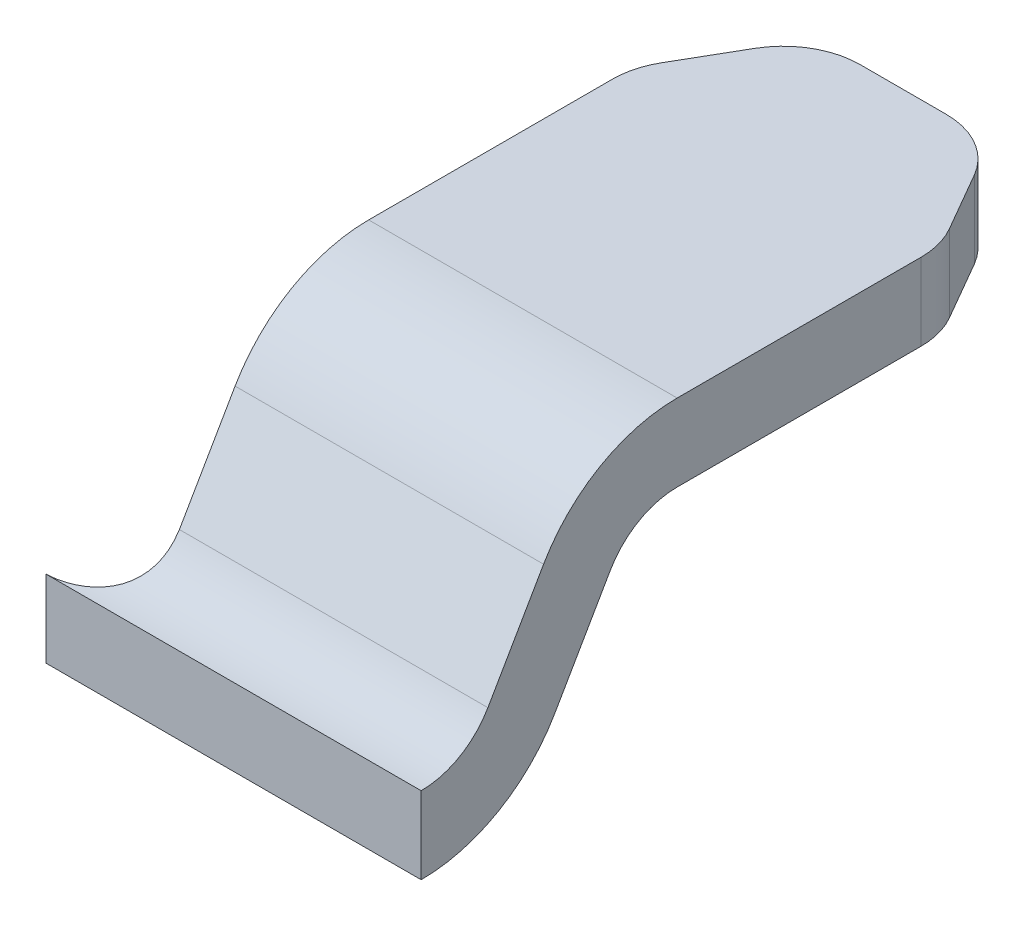
ISO-10303-21;
HEADER;
FILE_DESCRIPTION(('STEP AP214'),'2;1');
FILE_NAME('part.step','',(''),(''),'','','');
FILE_SCHEMA(('AUTOMOTIVE_DESIGN { 1 0 10303 214 1 1 1 1 }'));
ENDSEC;
DATA;
#1=APPLICATION_CONTEXT('core data for automotive mechanical design processes');
#2=APPLICATION_PROTOCOL_DEFINITION('international standard','automotive_design',2000,#1);
#3=PRODUCT_CONTEXT('',#1,'mechanical');
#4=PRODUCT('Part','Part','',(#3));
#5=PRODUCT_RELATED_PRODUCT_CATEGORY('part','',(#4));
#6=PRODUCT_DEFINITION_FORMATION('','',#4);
#7=PRODUCT_DEFINITION_CONTEXT('part definition',#1,'design');
#8=PRODUCT_DEFINITION('design','',#6,#7);
#9=PRODUCT_DEFINITION_SHAPE('','',#8);
#10=(LENGTH_UNIT() NAMED_UNIT(*) SI_UNIT(.MILLI.,.METRE.));
#11=(NAMED_UNIT(*) PLANE_ANGLE_UNIT() SI_UNIT($,.RADIAN.));
#12=(NAMED_UNIT(*) SI_UNIT($,.STERADIAN.) SOLID_ANGLE_UNIT());
#13=UNCERTAINTY_MEASURE_WITH_UNIT(LENGTH_MEASURE(1.E-05),#10,'distance_accuracy_value','');
#14=(GEOMETRIC_REPRESENTATION_CONTEXT(3) GLOBAL_UNCERTAINTY_ASSIGNED_CONTEXT((#13)) GLOBAL_UNIT_ASSIGNED_CONTEXT((#10,
#11,#12)) REPRESENTATION_CONTEXT('',''));
#15=CARTESIAN_POINT('',(0.,0.,0.));
#16=DIRECTION('',(0.,0.,1.));
#17=DIRECTION('',(1.,0.,0.));
#18=AXIS2_PLACEMENT_3D('',#15,#16,#17);
#19=CARTESIAN_POINT('',(-5.699968942605,3.500000000009,-3.65014050948));
#20=DIRECTION('',(0.,-2.126490095122E-11,1.));
#21=DIRECTION('',(0.,-1.,-2.126490095122E-11));
#22=AXIS2_PLACEMENT_3D('',#19,#20,#21);
#23=PLANE('',#22);
#24=DIRECTION('',(-2.263504939037E-11,1.,0.));
#25=VECTOR('',#24,1.);
#26=CARTESIAN_POINT('',(-5.699968942605,3.500000000008,-3.650140509429));
#27=LINE('',#26,#25);
#28=CARTESIAN_POINT('',(-5.69996894267712,5.95000004938576,-3.650140509429));
#29=VERTEX_POINT('',#28);
#30=CARTESIAN_POINT('',(-5.69996894266426,5.75000002470708,-3.650140509429));
#31=VERTEX_POINT('',#30);
#32=EDGE_CURVE('E410',#29,#31,#27,.F.);
#33=ORIENTED_EDGE('',*,*,#32,.F.);
#34=DIRECTION('',(-1.,-3.551554605963E-11,1.351452283416E-12));
#35=VECTOR('',#34,1.);
#36=CARTESIAN_POINT('',(-3.5999689427069,5.95000004946034,-3.65014050943184));
#37=LINE('',#36,#35);
#38=CARTESIAN_POINT('',(-6.67285812874747,5.9500000493512,-3.6501405094277));
#39=VERTEX_POINT('',#38);
#40=EDGE_CURVE('E439',#29,#39,#37,.T.);
#41=ORIENTED_EDGE('',*,*,#40,.T.);
#42=DIRECTION('',(-2.263504939037E-11,1.,2.126490095122E-11));
#43=VECTOR('',#42,1.);
#44=CARTESIAN_POINT('',(-6.67285812869157,3.49999999994734,-3.65014050947982));
#45=LINE('',#44,#43);
#46=CARTESIAN_POINT('',(-6.67285812879673,5.75000002467253,-3.65014050942983));
#47=VERTEX_POINT('',#46);
#48=EDGE_CURVE('E157',#39,#47,#45,.F.);
#49=ORIENTED_EDGE('',*,*,#48,.T.);
#50=DIRECTION('',(-1.,-3.551554605963E-11,1.351452283416E-12));
#51=VECTOR('',#50,1.);
#52=CARTESIAN_POINT('',(-3.59996894269979,5.75000002478167,-3.65014050943184));
#53=LINE('',#52,#51);
#54=EDGE_CURVE('E158',#31,#47,#53,.T.);
#55=ORIENTED_EDGE('',*,*,#54,.F.);
#56=EDGE_LOOP('',(#33,#41,#49,#55));
#57=FACE_BOUND('',#56,.T.);
#58=ADVANCED_FACE('F17',(#57),#23,.T.);
#59=CARTESIAN_POINT('',(-3.599968942714,6.150000000103,-3.649999999884));
#60=DIRECTION('',(-1.,-3.551554605963E-11,1.351452283416E-12));
#61=DIRECTION('',(3.551554605963E-11,-1.,0.));
#62=AXIS2_PLACEMENT_3D('',#59,#60,#61);
#63=CYLINDRICAL_SURFACE('',#62,0.2);
#64=CARTESIAN_POINT('',(-5.69996894269832,6.15000000002842,-3.64999999988116));
#65=DIRECTION('',(-1.,-3.551554605963E-11,1.351452283416E-12));
#66=DIRECTION('',(3.551554605963E-11,-1.,0.));
#67=AXIS2_PLACEMENT_3D('',#64,#65,#66);
#68=CIRCLE('',#67,0.2);
#69=CARTESIAN_POINT('',(-5.69996894267886,6.05000000001963,-3.82320508063325));
#70=VERTEX_POINT('',#69);
#71=EDGE_CURVE('E143',#70,#29,#68,.T.);
#72=ORIENTED_EDGE('',*,*,#71,.F.);
#73=DIRECTION('',(1.,8.29369051018556E-12,1.43650933458926E-11));
#74=VECTOR('',#73,1.);
#75=CARTESIAN_POINT('',(-3.599968942714,6.05000000002806,-3.82320508059732));
#76=LINE('',#75,#74);
#77=CARTESIAN_POINT('',(-6.50009724096356,6.05000000000395,-3.8232050806391));
#78=VERTEX_POINT('',#77);
#79=EDGE_CURVE('E137',#78,#70,#76,.T.);
#80=ORIENTED_EDGE('',*,*,#79,.F.);
#81=CARTESIAN_POINT('',(-6.50009724096355,6.05000000000389,-3.82320508063921));
#82=CARTESIAN_POINT('',(-6.50027779439027,6.04180177501456,-3.8184880911682));
#83=CARTESIAN_POINT('',(-6.50066283096496,6.03393993950835,-3.8131586965198));
#84=CARTESIAN_POINT('',(-6.50214723236821,6.01904413826587,-3.80145713343716));
#85=CARTESIAN_POINT('',(-6.50325049159644,6.01201493433766,-3.79507942250809));
#86=CARTESIAN_POINT('',(-6.50649046032339,5.99899691891201,-3.78148134066602));
#87=CARTESIAN_POINT('',(-6.50863295384615,5.99301418836139,-3.77425642722597));
#88=CARTESIAN_POINT('',(-6.51420230024425,5.98232745372562,-3.75940348178897));
#89=CARTESIAN_POINT('',(-6.51762437883242,5.97761880706675,-3.75177703772102));
#90=CARTESIAN_POINT('',(-6.52542139363501,5.96994317187697,-3.7374007378076));
#91=CARTESIAN_POINT('',(-6.52965501972936,5.96684365907508,-3.73064448068836));
#92=CARTESIAN_POINT('',(-6.53920309521606,5.96161080618487,-3.71752405957404));
#93=CARTESIAN_POINT('',(-6.5445186534827,5.95947846464955,-3.71116030664719));
#94=CARTESIAN_POINT('',(-6.55592005902789,5.95608141431003,-3.69931966641478));
#95=CARTESIAN_POINT('',(-6.56197591301083,5.95479119006002,-3.69382095875297));
#96=CARTESIAN_POINT('',(-6.57483738683504,5.95278523118182,-3.68366281258559));
#97=CARTESIAN_POINT('',(-6.58164317311259,5.95206962437463,-3.67900356099184));
#98=CARTESIAN_POINT('',(-6.59658011011388,5.95097066746399,-3.67022236671587));
#99=CARTESIAN_POINT('',(-6.60477558921674,5.95062901378791,-3.6662048290624));
#100=CARTESIAN_POINT('',(-6.62168455453615,5.95019483442758,-3.65945448749944));
#101=CARTESIAN_POINT('',(-6.63039795717038,5.95010226865657,-3.65672147692408));
#102=CARTESIAN_POINT('',(-6.64478047300666,5.95002455662213,-3.65338200668197));
#103=CARTESIAN_POINT('',(-6.6503569225307,5.95001204890544,-3.6523622421306));
#104=CARTESIAN_POINT('',(-6.66157083672502,5.95000087516357,-3.65085347021194));
#105=CARTESIAN_POINT('',(-6.6672081717618,5.95000218396852,-3.65036349950233));
#106=CARTESIAN_POINT('',(-6.67285812874703,5.9500000493512,-3.65014050942772));
#107=B_SPLINE_CURVE_WITH_KNOTS('',3,(#81,#82,#83,#84,#85,#86,#87,#88,#89,#90,#91,#92,#93,#94,
#95,#96,#97,#98,#99,#100,#101,#102,#103,#104,#105,#106),.UNSPECIFIED.,.F.,.F.,(4,2,2,2,2,2,2,2,
2,2,2,2,4),(0.,0.0283828798519999,0.0569209558916135,0.0856197199956834,0.114212457002599,
0.139742802926945,0.16529944791172,0.190040561556663,0.214787177224521,0.242076610263373,
0.269361651236865,0.286345287768334,0.303297990167384),.UNSPECIFIED.);
#108=EDGE_CURVE('E20',#78,#39,#107,.T.);
#109=ORIENTED_EDGE('',*,*,#108,.T.);
#110=ORIENTED_EDGE('',*,*,#40,.F.);
#111=EDGE_LOOP('',(#72,#80,#109,#110));
#112=FACE_BOUND('',#111,.T.);
#113=ADVANCED_FACE('F139',(#112),#63,.F.);
#114=CARTESIAN_POINT('',(-3.599968942714,6.100000000103,-4.313952809452));
#115=DIRECTION('',(-1.,-3.551554605963E-11,1.351452283416E-12));
#116=DIRECTION('',(3.551554605963E-11,-1.,0.));
#117=AXIS2_PLACEMENT_3D('',#114,#115,#116);
#118=CYLINDRICAL_SURFACE('',#117,0.4);
#119=DIRECTION('',(-1.,-3.551554605963E-11,0.));
#120=VECTOR('',#119,1.);
#121=CARTESIAN_POINT('',(-3.599968942714,6.50000000010272,-4.31395280947));
#122=LINE('',#121,#120);
#123=CARTESIAN_POINT('',(-6.49996894267895,6.50000000000143,-4.31395280945904));
#124=VERTEX_POINT('',#123);
#125=CARTESIAN_POINT('',(-5.69996894268224,6.50000000003328,-4.31395280945958));
#126=VERTEX_POINT('',#125);
#127=EDGE_CURVE('E164',#124,#126,#122,.F.);
#128=ORIENTED_EDGE('',*,*,#127,.F.);
#129=CARTESIAN_POINT('',(-6.49996894267179,6.10000000000001,-4.31395280944808));
#130=DIRECTION('',(-1.,-3.551554605963E-11,1.351452283416E-12));
#131=DIRECTION('',(3.551554605963E-11,-1.,0.));
#132=AXIS2_PLACEMENT_3D('',#129,#130,#131);
#133=CIRCLE('',#132,0.4);
#134=CARTESIAN_POINT('',(-6.49996894267843,6.30000000001457,-3.96754264794256));
#135=VERTEX_POINT('',#134);
#136=EDGE_CURVE('E396',#135,#124,#133,.T.);
#137=ORIENTED_EDGE('',*,*,#136,.F.);
#138=DIRECTION('',(1.,8.29369051018556E-12,1.43650933458926E-11));
#139=VECTOR('',#138,1.);
#140=CARTESIAN_POINT('',(-3.599968942714,6.30000000004427,-3.96754264790409));
#141=LINE('',#140,#139);
#142=CARTESIAN_POINT('',(-5.69996894267619,6.30000000002692,-3.96754264793413));
#143=VERTEX_POINT('',#142);
#144=EDGE_CURVE('E148',#143,#135,#141,.F.);
#145=ORIENTED_EDGE('',*,*,#144,.F.);
#146=CARTESIAN_POINT('',(-5.69996894267737,6.10000000002842,-4.31395280944916));
#147=DIRECTION('',(-1.,-3.551554605963E-11,1.351452283416E-12));
#148=DIRECTION('',(3.551554605963E-11,-1.,0.));
#149=AXIS2_PLACEMENT_3D('',#146,#147,#148);
#150=CIRCLE('',#149,0.4);
#151=EDGE_CURVE('E403',#126,#143,#150,.F.);
#152=ORIENTED_EDGE('',*,*,#151,.F.);
#153=EDGE_LOOP('',(#128,#137,#145,#152));
#154=FACE_BOUND('',#153,.T.);
#155=ADVANCED_FACE('F186',(#154),#118,.T.);
#156=CARTESIAN_POINT('',(-3.599968942714,5.950000000103,-3.996410161398));
#157=DIRECTION('',(1.65873810203699E-11,-0.499999999999899,-0.866025403784497));
#158=DIRECTION('',(0.,0.866025403784497,-0.499999999999899));
#159=AXIS2_PLACEMENT_3D('',#156,#157,#158);
#160=PLANE('',#159);
#161=DIRECTION('',(-1.,-3.551554605963E-11,1.351452283416E-12));
#162=VECTOR('',#161,1.);
#163=CARTESIAN_POINT('',(-3.59996894270737,5.95000000010811,-3.99641016140072));
#164=LINE('',#163,#162);
#165=CARTESIAN_POINT('',(-6.49996894266563,5.95000000000225,-3.99641016139534));
#166=VERTEX_POINT('',#165);
#167=CARTESIAN_POINT('',(-5.69996894266773,5.95000000002876,-3.99641016139544));
#168=VERTEX_POINT('',#167);
#169=EDGE_CURVE('E437',#166,#168,#164,.F.);
#170=ORIENTED_EDGE('',*,*,#169,.F.);
#171=DIRECTION('',(1.96022008841507E-11,-0.866025403783781,0.500000000001139));
#172=VECTOR('',#171,1.);
#173=CARTESIAN_POINT('',(-6.49996894266511,6.200000000007,-4.140747728696));
#174=LINE('',#173,#172);
#175=CARTESIAN_POINT('',(-6.49996894268266,6.20000000000717,-4.14074772869571));
#176=VERTEX_POINT('',#175);
#177=EDGE_CURVE('E392',#176,#166,#174,.T.);
#178=ORIENTED_EDGE('',*,*,#177,.F.);
#179=DIRECTION('',(-1.,-3.551554605963E-11,1.351452283416E-12));
#180=VECTOR('',#179,1.);
#181=CARTESIAN_POINT('',(-3.59996894271732,6.20000000011033,-4.14074772869934));
#182=LINE('',#181,#180);
#183=CARTESIAN_POINT('',(-5.69996894268206,6.20000000002987,-4.14074772869325));
#184=VERTEX_POINT('',#183);
#185=EDGE_CURVE('E400',#176,#184,#182,.F.);
#186=ORIENTED_EDGE('',*,*,#185,.T.);
#187=DIRECTION('',(-1.96022008843363E-11,0.866025403785049,-0.499999999998943));
#188=VECTOR('',#187,1.);
#189=CARTESIAN_POINT('',(-5.69996894266046,5.950000000024,-3.996410161393));
#190=LINE('',#189,#188);
#191=EDGE_CURVE('E409',#168,#184,#190,.T.);
#192=ORIENTED_EDGE('',*,*,#191,.F.);
#193=EDGE_LOOP('',(#170,#178,#186,#192));
#194=FACE_BOUND('',#193,.T.);
#195=ADVANCED_FACE('F182',(#194),#160,.T.);
#196=CARTESIAN_POINT('',(-3.599968942714,6.150000000103,-3.649999999884));
#197=DIRECTION('',(-1.,-3.551554605963E-11,1.351452283416E-12));
#198=DIRECTION('',(3.551554605963E-11,-1.,0.));
#199=AXIS2_PLACEMENT_3D('',#196,#197,#198);
#200=CYLINDRICAL_SURFACE('',#199,0.4);
#201=CARTESIAN_POINT('',(-6.67285812874499,5.75000002467253,-3.65014050943187));
#202=CARTESIAN_POINT('',(-6.66276903925641,5.75001060580209,-3.65053078995445));
#203=CARTESIAN_POINT('',(-6.65271634494505,5.75000131045122,-3.65178649992532));
#204=CARTESIAN_POINT('',(-6.63296313150004,5.75003615282917,-3.65595551333938));
#205=CARTESIAN_POINT('',(-6.62326252598787,5.75008027735987,-3.65886840725865));
#206=CARTESIAN_POINT('',(-6.60448151002414,5.75031513508185,-3.66628119837156));
#207=CARTESIAN_POINT('',(-6.59540150715223,5.75050596363218,-3.67078212677313));
#208=CARTESIAN_POINT('',(-6.57813281158542,5.75118691255975,-3.68123457741161));
#209=CARTESIAN_POINT('',(-6.56994387989525,5.75167695245087,-3.68718570929359));
#210=CARTESIAN_POINT('',(-6.55477936131802,5.7531189963216,-3.70028157227595));
#211=CARTESIAN_POINT('',(-6.54779191225092,5.75406608436189,-3.7074130829485));
#212=CARTESIAN_POINT('',(-6.53513443181458,5.75657975828739,-3.72266387303066));
#213=CARTESIAN_POINT('',(-6.5294637277814,5.75814602675194,-3.73078264485005));
#214=CARTESIAN_POINT('',(-6.51975481422064,5.7619519502913,-3.74741086685393));
#215=CARTESIAN_POINT('',(-6.51566710526881,5.76416655464111,-3.75589723044443));
#216=CARTESIAN_POINT('',(-6.50891074035316,5.76934068635508,-3.77320722318115));
#217=CARTESIAN_POINT('',(-6.50624280403431,5.77230059037422,-3.78203102093971));
#218=CARTESIAN_POINT('',(-6.50280779230196,5.77810198593914,-3.79744966016726));
#219=CARTESIAN_POINT('',(-6.50172955371984,5.78078139477875,-3.80403942795247));
#220=CARTESIAN_POINT('',(-6.50031011532164,5.78651203838595,-3.81711642866073));
#221=CARTESIAN_POINT('',(-6.49996701674113,5.78956229369722,-3.82360388266987));
#222=CARTESIAN_POINT('',(-6.49996894265495,5.79278857796608,-3.82999999979268));
#223=B_SPLINE_CURVE_WITH_KNOTS('',3,(#201,#202,#203,#204,#205,#206,#207,#208,#209,#210,#211,
#212,#213,#214,#215,#216,#217,#218,#219,#220,#221,#222),.UNSPECIFIED.,.F.,.F.,(4,2,2,2,2,2,2,2,
2,2,4),(0.,0.0302505519788779,0.0604936316753317,0.0907563863081787,0.121011004019698,
0.150947225011804,0.180868119166092,0.209758479597707,0.238663469870065,0.260201633917041,
0.28168410048437),.UNSPECIFIED.);
#224=CARTESIAN_POINT('',(-6.49996894266325,5.79278857796801,-3.82999999979642));
#225=VERTEX_POINT('',#224);
#226=EDGE_CURVE('E149',#47,#225,#223,.T.);
#227=ORIENTED_EDGE('',*,*,#226,.T.);
#228=CARTESIAN_POINT('',(-6.49996894267844,6.15000000000001,-3.64999999988008));
#229=DIRECTION('',(-1.,-3.551554605963E-11,1.351452283416E-12));
#230=DIRECTION('',(3.551554605963E-11,-1.,0.));
#231=AXIS2_PLACEMENT_3D('',#228,#229,#230);
#232=CIRCLE('',#231,0.4);
#233=EDGE_CURVE('E389',#166,#225,#232,.T.);
#234=ORIENTED_EDGE('',*,*,#233,.F.);
#235=ORIENTED_EDGE('',*,*,#169,.T.);
#236=CARTESIAN_POINT('',(-5.69996894268164,6.15000000002842,-3.64999999988116));
#237=DIRECTION('',(-1.,-3.551554605963E-11,1.351452283416E-12));
#238=DIRECTION('',(3.551554605963E-11,-1.,0.));
#239=AXIS2_PLACEMENT_3D('',#236,#237,#238);
#240=CIRCLE('',#239,0.4);
#241=EDGE_CURVE('E407',#31,#168,#240,.F.);
#242=ORIENTED_EDGE('',*,*,#241,.F.);
#243=ORIENTED_EDGE('',*,*,#54,.T.);
#244=EDGE_LOOP('',(#227,#234,#235,#242,#243));
#245=FACE_BOUND('',#244,.T.);
#246=ADVANCED_FACE('F178',(#245),#200,.T.);
#247=CARTESIAN_POINT('',(-6.679968942604,3.499999999951,-3.829999999987));
#248=DIRECTION('',(-2.263504939037E-11,1.,2.126490095122E-11));
#249=DIRECTION('',(-1.,-2.263504939037E-11,0.));
#250=AXIS2_PLACEMENT_3D('',#247,#248,#249);
#251=CYLINDRICAL_SURFACE('',#250,0.18);
#252=DIRECTION('',(2.263504939037E-11,-1.,0.));
#253=VECTOR('',#252,1.);
#254=CARTESIAN_POINT('',(-6.499968942604,3.499999999951,-3.8299999998));
#255=LINE('',#254,#253);
#256=CARTESIAN_POINT('',(-6.49996894266199,6.06176914533899,-3.82999999986626));
#257=VERTEX_POINT('',#256);
#258=EDGE_CURVE('E385',#225,#257,#255,.F.);
#259=ORIENTED_EDGE('',*,*,#258,.F.);
#260=ORIENTED_EDGE('',*,*,#226,.F.);
#261=ORIENTED_EDGE('',*,*,#48,.F.);
#262=ORIENTED_EDGE('',*,*,#108,.F.);
#263=CARTESIAN_POINT('',(-6.67996894266199,6.06176914544779,-3.82999999993252));
#264=DIRECTION('',(-1.65873810203706E-11,0.500000000000017,0.866025403784429));
#265=DIRECTION('',(-1.65599748198898E-11,0.866025403784429,-0.500000000000017));
#266=AXIS2_PLACEMENT_3D('',#263,#264,#265);
#267=ELLIPSE('',#266,0.359999999986728,0.18);
#268=EDGE_CURVE('E154',#257,#78,#267,.F.);
#269=ORIENTED_EDGE('',*,*,#268,.F.);
#270=EDGE_LOOP('',(#259,#260,#261,#262,#269));
#271=FACE_BOUND('',#270,.T.);
#272=ADVANCED_FACE('F153',(#271),#251,.F.);
#273=CARTESIAN_POINT('',(-3.599968942714,6.300000000103,-3.967542647938));
#274=DIRECTION('',(-1.65873810203706E-11,0.500000000000017,0.866025403784429));
#275=DIRECTION('',(0.,-0.866025403784429,0.500000000000017));
#276=AXIS2_PLACEMENT_3D('',#273,#274,#275);
#277=PLANE('',#276);
#278=DIRECTION('',(-1.9602603270502E-11,0.866025403742388,-0.500000000072834));
#279=VECTOR('',#278,1.);
#280=CARTESIAN_POINT('',(-6.49996894266199,6.061769145378,-3.829999999862));
#281=LINE('',#280,#279);
#282=EDGE_CURVE('E162',#257,#135,#281,.T.);
#283=ORIENTED_EDGE('',*,*,#282,.F.);
#284=ORIENTED_EDGE('',*,*,#268,.T.);
#285=ORIENTED_EDGE('',*,*,#79,.T.);
#286=DIRECTION('',(1.96022008846734E-11,-0.866025403786084,0.49999999999715));
#287=VECTOR('',#286,1.);
#288=CARTESIAN_POINT('',(-5.69996894266838,6.300000000027,-3.967542647934));
#289=LINE('',#288,#287);
#290=EDGE_CURVE('E402',#143,#70,#289,.T.);
#291=ORIENTED_EDGE('',*,*,#290,.F.);
#292=ORIENTED_EDGE('',*,*,#144,.T.);
#293=EDGE_LOOP('',(#283,#284,#285,#291,#292));
#294=FACE_BOUND('',#293,.T.);
#295=ADVANCED_FACE('F159',(#294),#277,.T.);
#296=CARTESIAN_POINT('',(-3.599968942714,6.500000000103,-5.399999999884));
#297=DIRECTION('',(-3.551554605963E-11,1.,2.614766152764E-13));
#298=DIRECTION('',(-1.,-3.551554605963E-11,0.));
#299=AXIS2_PLACEMENT_3D('',#296,#297,#298);
#300=PLANE('',#299);
#301=CARTESIAN_POINT('',(-6.29996894267191,6.50000000001553,-4.94641016143721));
#302=DIRECTION('',(-2.263504939037E-11,1.,2.126490095122E-11));
#303=DIRECTION('',(-1.,-2.263504939037E-11,0.));
#304=AXIS2_PLACEMENT_3D('',#301,#302,#303);
#305=CIRCLE('',#304,0.2);
#306=CARTESIAN_POINT('',(-6.4999689426719,6.5000000000065,-4.9464101614266));
#307=VERTEX_POINT('',#306);
#308=CARTESIAN_POINT('',(-6.47317402342659,6.50000000002237,-5.04641016144113));
#309=VERTEX_POINT('',#308);
#310=EDGE_CURVE('E369',#307,#309,#305,.F.);
#311=ORIENTED_EDGE('',*,*,#310,.F.);
#312=DIRECTION('',(0.,0.,1.));
#313=VECTOR('',#312,1.);
#314=CARTESIAN_POINT('',(-6.4999689426719,6.500000000002,-3.829999999987));
#315=LINE('',#314,#313);
#316=EDGE_CURVE('E371',#124,#307,#315,.F.);
#317=ORIENTED_EDGE('',*,*,#316,.F.);
#318=ORIENTED_EDGE('',*,*,#127,.T.);
#319=DIRECTION('',(0.,0.,1.));
#320=VECTOR('',#319,1.);
#321=CARTESIAN_POINT('',(-5.69996894267291,6.500000000035,-5.046410161501));
#322=LINE('',#321,#320);
#323=CARTESIAN_POINT('',(-5.69996894267291,6.50000000003524,-4.9464101614511));
#324=VERTEX_POINT('',#323);
#325=EDGE_CURVE('E406',#324,#126,#322,.T.);
#326=ORIENTED_EDGE('',*,*,#325,.F.);
#327=CARTESIAN_POINT('',(-5.8999689426729,6.50000000003095,-4.94641016143721));
#328=DIRECTION('',(-2.263504939037E-11,1.,2.126490095122E-11));
#329=DIRECTION('',(-1.,-2.263504939037E-11,0.));
#330=AXIS2_PLACEMENT_3D('',#327,#328,#329);
#331=CIRCLE('',#330,0.2);
#332=CARTESIAN_POINT('',(-5.72676386191499,6.5000000000425,-5.0464101614359));
#333=VERTEX_POINT('',#332);
#334=EDGE_CURVE('E411',#333,#324,#331,.F.);
#335=ORIENTED_EDGE('',*,*,#334,.F.);
#336=DIRECTION('',(-0.49999999999819,0.,-0.866025403785483));
#337=VECTOR('',#336,1.);
#338=CARTESIAN_POINT('',(-5.81543899652055,6.500000000048,-5.19999999994165));
#339=LINE('',#338,#337);
#340=CARTESIAN_POINT('',(-5.81543899651036,6.5000000000399,-5.199999999924));
#341=VERTEX_POINT('',#340);
#342=EDGE_CURVE('E418',#341,#333,#339,.F.);
#343=ORIENTED_EDGE('',*,*,#342,.F.);
#344=CARTESIAN_POINT('',(-5.9886440772669,6.50000000002575,-5.09999999992321));
#345=DIRECTION('',(-2.263504939037E-11,1.,2.126490095122E-11));
#346=DIRECTION('',(-1.,-2.263504939037E-11,0.));
#347=AXIS2_PLACEMENT_3D('',#344,#345,#346);
#348=CIRCLE('',#347,0.2);
#349=CARTESIAN_POINT('',(-5.98864407662526,6.5000000000355,-5.29999999990199));
#350=VERTEX_POINT('',#349);
#351=EDGE_CURVE('E170',#350,#341,#348,.F.);
#352=ORIENTED_EDGE('',*,*,#351,.F.);
#353=DIRECTION('',(-1.,0.,1.351452283416E-12));
#354=VECTOR('',#353,1.);
#355=CARTESIAN_POINT('',(-3.599968942714,6.500000000041,-5.299999999884));
#356=LINE('',#355,#354);
#357=CARTESIAN_POINT('',(-6.2112938089285,6.50000000003202,-5.29999999990184));
#358=VERTEX_POINT('',#357);
#359=EDGE_CURVE('E166',#358,#350,#356,.F.);
#360=ORIENTED_EDGE('',*,*,#359,.F.);
#361=CARTESIAN_POINT('',(-6.2112938080779,6.50000000001879,-5.09999999992321));
#362=DIRECTION('',(-2.263504939037E-11,1.,2.126490095122E-11));
#363=DIRECTION('',(-1.,-2.263504939037E-11,0.));
#364=AXIS2_PLACEMENT_3D('',#361,#362,#363);
#365=CIRCLE('',#364,0.2);
#366=CARTESIAN_POINT('',(-6.38449888883501,6.500000000024,-5.19999999992273));
#367=VERTEX_POINT('',#366);
#368=EDGE_CURVE('E453',#367,#358,#365,.F.);
#369=ORIENTED_EDGE('',*,*,#368,.F.);
#370=DIRECTION('',(-0.499999999998072,0.,0.866025403785552));
#371=VECTOR('',#370,1.);
#372=CARTESIAN_POINT('',(-6.4731740233843,6.500000000031,-5.04641016151446));
#373=LINE('',#372,#371);
#374=EDGE_CURVE('E374',#309,#367,#373,.F.);
#375=ORIENTED_EDGE('',*,*,#374,.F.);
#376=EDGE_LOOP('',(#311,#317,#318,#326,#335,#343,#352,#360,#369,#375));
#377=FACE_BOUND('',#376,.T.);
#378=ADVANCED_FACE('F243',(#377),#300,.T.);
#379=CARTESIAN_POINT('',(-3.599968942714,6.300000000104,-5.299999999884));
#380=DIRECTION('',(-1.351452283416E-12,0.,-1.));
#381=DIRECTION('',(-1.,0.,1.351452283416E-12));
#382=AXIS2_PLACEMENT_3D('',#379,#380,#381);
#383=PLANE('',#382);
#384=DIRECTION('',(1.,3.551554605963E-11,0.));
#385=VECTOR('',#384,1.);
#386=CARTESIAN_POINT('',(-3.599968942714,6.30000000010352,-5.299999999927));
#387=LINE('',#386,#385);
#388=CARTESIAN_POINT('',(-6.21129380847643,6.30000000003639,-5.29999999992712));
#389=VERTEX_POINT('',#388);
#390=CARTESIAN_POINT('',(-5.98864407681219,6.30000000003044,-5.29999999992712));
#391=VERTEX_POINT('',#390);
#392=EDGE_CURVE('E452',#389,#391,#387,.T.);
#393=ORIENTED_EDGE('',*,*,#392,.F.);
#394=DIRECTION('',(-2.263504939037E-11,1.,2.126490095122E-11));
#395=VECTOR('',#394,1.);
#396=CARTESIAN_POINT('',(-6.2112938088161,3.50000000001225,-5.299999999987));
#397=LINE('',#396,#395);
#398=EDGE_CURVE('E432',#358,#389,#397,.F.);
#399=ORIENTED_EDGE('',*,*,#398,.F.);
#400=ORIENTED_EDGE('',*,*,#359,.T.);
#401=DIRECTION('',(-2.263504939037E-11,1.,2.126490095122E-11));
#402=VECTOR('',#401,1.);
#403=CARTESIAN_POINT('',(-5.98864407629862,3.50000000001225,-5.299999999987));
#404=LINE('',#403,#402);
#405=EDGE_CURVE('E428',#391,#350,#404,.T.);
#406=ORIENTED_EDGE('',*,*,#405,.F.);
#407=EDGE_LOOP('',(#393,#399,#400,#406));
#408=FACE_BOUND('',#407,.T.);
#409=ADVANCED_FACE('F239',(#408),#383,.T.);
#410=CARTESIAN_POINT('',(-5.988644077199,3.500000000008,-5.099999999987));
#411=DIRECTION('',(-2.263504939037E-11,1.,2.126490095122E-11));
#412=DIRECTION('',(-1.,-2.263504939037E-11,0.));
#413=AXIS2_PLACEMENT_3D('',#410,#411,#412);
#414=CYLINDRICAL_SURFACE('',#413,0.2);
#415=ORIENTED_EDGE('',*,*,#405,.T.);
#416=ORIENTED_EDGE('',*,*,#351,.T.);
#417=DIRECTION('',(-2.61842592591617E-11,1.,1.5117489131735E-11));
#418=VECTOR('',#417,1.);
#419=CARTESIAN_POINT('',(-5.81543899643245,3.500000000008,-5.19999999997046));
#420=LINE('',#419,#418);
#421=CARTESIAN_POINT('',(-5.81543899650588,6.30000000003439,-5.19999999992807));
#422=VERTEX_POINT('',#421);
#423=EDGE_CURVE('E421',#422,#341,#420,.T.);
#424=ORIENTED_EDGE('',*,*,#423,.F.);
#425=CARTESIAN_POINT('',(-5.98864407726238,6.30000000003795,-5.09999999992746));
#426=DIRECTION('',(-2.263504939037E-11,1.,2.126490095122E-11));
#427=DIRECTION('',(-1.,-2.263504939037E-11,0.));
#428=AXIS2_PLACEMENT_3D('',#425,#426,#427);
#429=CIRCLE('',#428,0.2);
#430=EDGE_CURVE('E450',#391,#422,#429,.F.);
#431=ORIENTED_EDGE('',*,*,#430,.F.);
#432=EDGE_LOOP('',(#415,#416,#424,#431));
#433=FACE_BOUND('',#432,.T.);
#434=ADVANCED_FACE('F235',(#433),#414,.T.);
#435=CARTESIAN_POINT('',(-5.815438996442,3.500000000008,-5.199999999987));
#436=DIRECTION('',(0.866025403785483,3.02349782635794E-11,-0.49999999999819));
#437=DIRECTION('',(-0.49999999999819,0.,-0.866025403785483));
#438=AXIS2_PLACEMENT_3D('',#435,#436,#437);
#439=PLANE('',#438);
#440=ORIENTED_EDGE('',*,*,#423,.T.);
#441=ORIENTED_EDGE('',*,*,#342,.T.);
#442=DIRECTION('',(-2.263504939037E-11,1.,2.126490095122E-11));
#443=VECTOR('',#442,1.);
#444=CARTESIAN_POINT('',(-5.72676386184667,3.50000000001405,-5.04641016149851));
#445=LINE('',#444,#443);
#446=CARTESIAN_POINT('',(-5.72676386191063,6.30000000003669,-5.04641016144006));
#447=VERTEX_POINT('',#446);
#448=EDGE_CURVE('E412',#447,#333,#445,.T.);
#449=ORIENTED_EDGE('',*,*,#448,.F.);
#450=DIRECTION('',(0.499999999998243,1.73080830647458E-11,0.866025403785453));
#451=VECTOR('',#450,1.);
#452=CARTESIAN_POINT('',(-5.815438996506,6.30000000002478,-5.199999999928));
#453=LINE('',#452,#451);
#454=EDGE_CURVE('E449',#422,#447,#453,.T.);
#455=ORIENTED_EDGE('',*,*,#454,.F.);
#456=EDGE_LOOP('',(#440,#441,#449,#455));
#457=FACE_BOUND('',#456,.T.);
#458=ADVANCED_FACE('F231',(#457),#439,.T.);
#459=CARTESIAN_POINT('',(-5.899968942605,3.500000000008,-4.946410161501));
#460=DIRECTION('',(-2.263504939037E-11,1.,2.126490095122E-11));
#461=DIRECTION('',(-1.,-2.263504939037E-11,0.));
#462=AXIS2_PLACEMENT_3D('',#459,#460,#461);
#463=CYLINDRICAL_SURFACE('',#462,0.2);
#464=ORIENTED_EDGE('',*,*,#448,.T.);
#465=ORIENTED_EDGE('',*,*,#334,.T.);
#466=DIRECTION('',(-2.263504939037E-11,1.,0.));
#467=VECTOR('',#466,1.);
#468=CARTESIAN_POINT('',(-5.699968942605,3.500000000008,-4.946410161465));
#469=LINE('',#468,#467);
#470=CARTESIAN_POINT('',(-5.69996894266959,6.30000000003637,-4.94641016145323));
#471=VERTEX_POINT('',#470);
#472=EDGE_CURVE('E425',#471,#324,#469,.T.);
#473=ORIENTED_EDGE('',*,*,#472,.F.);
#474=CARTESIAN_POINT('',(-5.89996894266838,6.30000000003947,-4.94641016144146));
#475=DIRECTION('',(-2.263504939037E-11,1.,2.126490095122E-11));
#476=DIRECTION('',(-1.,-2.263504939037E-11,0.));
#477=AXIS2_PLACEMENT_3D('',#474,#475,#476);
#478=CIRCLE('',#477,0.2);
#479=EDGE_CURVE('E445',#447,#471,#478,.F.);
#480=ORIENTED_EDGE('',*,*,#479,.F.);
#481=EDGE_LOOP('',(#464,#465,#473,#480));
#482=FACE_BOUND('',#481,.T.);
#483=ADVANCED_FACE('F227',(#482),#463,.T.);
#484=CARTESIAN_POINT('',(-5.699968942605,3.500000000008,-5.046410161501));
#485=DIRECTION('',(1.,2.263504939037E-11,0.));
#486=DIRECTION('',(-2.263504939037E-11,1.,0.));
#487=AXIS2_PLACEMENT_3D('',#484,#485,#486);
#488=PLANE('',#487);
#489=ORIENTED_EDGE('',*,*,#290,.T.);
#490=ORIENTED_EDGE('',*,*,#71,.T.);
#491=ORIENTED_EDGE('',*,*,#32,.T.);
#492=ORIENTED_EDGE('',*,*,#241,.T.);
#493=ORIENTED_EDGE('',*,*,#191,.T.);
#494=CARTESIAN_POINT('',(-5.69996894269468,6.10000000002842,-4.31395280944916));
#495=DIRECTION('',(-1.,-3.551554605963E-11,1.351452283416E-12));
#496=DIRECTION('',(3.551554605963E-11,-1.,0.));
#497=AXIS2_PLACEMENT_3D('',#494,#495,#496);
#498=CIRCLE('',#497,0.2);
#499=CARTESIAN_POINT('',(-5.69996894268589,6.30000000002842,-4.31395280946253));
#500=VERTEX_POINT('',#499);
#501=EDGE_CURVE('E398',#184,#500,#498,.T.);
#502=ORIENTED_EDGE('',*,*,#501,.T.);
#503=DIRECTION('',(0.,-5.231752751578E-13,1.));
#504=VECTOR('',#503,1.);
#505=CARTESIAN_POINT('',(-5.69996894267,6.30000000002842,-4.313952809452));
#506=LINE('',#505,#504);
#507=EDGE_CURVE('E448',#471,#500,#506,.T.);
#508=ORIENTED_EDGE('',*,*,#507,.F.);
#509=ORIENTED_EDGE('',*,*,#472,.T.);
#510=ORIENTED_EDGE('',*,*,#325,.T.);
#511=ORIENTED_EDGE('',*,*,#151,.T.);
#512=EDGE_LOOP('',(#489,#490,#491,#492,#493,#502,#508,#509,#510,#511));
#513=FACE_BOUND('',#512,.T.);
#514=ADVANCED_FACE('F223',(#513),#488,.T.);
#515=CARTESIAN_POINT('',(-3.599968942714,6.100000000103,-4.313952809452));
#516=DIRECTION('',(-1.,-3.551554605963E-11,1.351452283416E-12));
#517=DIRECTION('',(3.551554605963E-11,-1.,0.));
#518=AXIS2_PLACEMENT_3D('',#515,#516,#517);
#519=CYLINDRICAL_SURFACE('',#518,0.2);
#520=ORIENTED_EDGE('',*,*,#501,.F.);
#521=ORIENTED_EDGE('',*,*,#185,.F.);
#522=CARTESIAN_POINT('',(-6.4999689426969,6.10000000000001,-4.31395280944808));
#523=DIRECTION('',(-1.,-3.551554605963E-11,1.351452283416E-12));
#524=DIRECTION('',(3.551554605963E-11,-1.,0.));
#525=AXIS2_PLACEMENT_3D('',#522,#523,#524);
#526=CIRCLE('',#525,0.2);
#527=CARTESIAN_POINT('',(-6.499968942704,6.30000000000001,-4.31395280946199));
#528=VERTEX_POINT('',#527);
#529=EDGE_CURVE('E393',#528,#176,#526,.F.);
#530=ORIENTED_EDGE('',*,*,#529,.F.);
#531=DIRECTION('',(1.,3.551554605963E-11,0.));
#532=VECTOR('',#531,1.);
#533=CARTESIAN_POINT('',(-3.599968942714,6.300000000103,-4.313952809476));
#534=LINE('',#533,#532);
#535=EDGE_CURVE('E466',#500,#528,#534,.F.);
#536=ORIENTED_EDGE('',*,*,#535,.F.);
#537=EDGE_LOOP('',(#520,#521,#530,#536));
#538=FACE_BOUND('',#537,.T.);
#539=ADVANCED_FACE('F219',(#538),#519,.F.);
#540=CARTESIAN_POINT('',(-6.499968942604,3.499999999951,-3.829999999987));
#541=DIRECTION('',(-1.,-2.263504939037E-11,0.));
#542=DIRECTION('',(2.263504939037E-11,-1.,0.));
#543=AXIS2_PLACEMENT_3D('',#540,#541,#542);
#544=PLANE('',#543);
#545=ORIENTED_EDGE('',*,*,#258,.T.);
#546=ORIENTED_EDGE('',*,*,#282,.T.);
#547=ORIENTED_EDGE('',*,*,#136,.T.);
#548=ORIENTED_EDGE('',*,*,#316,.T.);
#549=DIRECTION('',(2.263504939037E-11,-1.,0.));
#550=VECTOR('',#549,1.);
#551=CARTESIAN_POINT('',(-6.499968942604,3.499999999951,-4.946410161416));
#552=LINE('',#551,#550);
#553=CARTESIAN_POINT('',(-6.49996894269484,6.3000000000258,-4.94641016142873));
#554=VERTEX_POINT('',#553);
#555=EDGE_CURVE('E377',#554,#307,#552,.F.);
#556=ORIENTED_EDGE('',*,*,#555,.F.);
#557=DIRECTION('',(0.,-5.231752751578E-13,1.));
#558=VECTOR('',#557,1.);
#559=CARTESIAN_POINT('',(-6.499968942704,6.30000000000001,-4.313952809452));
#560=LINE('',#559,#558);
#561=EDGE_CURVE('E444',#528,#554,#560,.F.);
#562=ORIENTED_EDGE('',*,*,#561,.F.);
#563=ORIENTED_EDGE('',*,*,#529,.T.);
#564=ORIENTED_EDGE('',*,*,#177,.T.);
#565=ORIENTED_EDGE('',*,*,#233,.T.);
#566=EDGE_LOOP('',(#545,#546,#547,#548,#556,#562,#563,#564,#565));
#567=FACE_BOUND('',#566,.T.);
#568=ADVANCED_FACE('F215',(#567),#544,.T.);
#569=CARTESIAN_POINT('',(-6.299968942604,3.500000000008,-4.946410161501));
#570=DIRECTION('',(-2.263504939037E-11,1.,2.126490095122E-11));
#571=DIRECTION('',(-1.,-2.263504939037E-11,0.));
#572=AXIS2_PLACEMENT_3D('',#569,#570,#571);
#573=CYLINDRICAL_SURFACE('',#572,0.2);
#574=ORIENTED_EDGE('',*,*,#555,.T.);
#575=ORIENTED_EDGE('',*,*,#310,.T.);
#576=DIRECTION('',(-7.76831482648784E-12,1.,-4.48503865619946E-12));
#577=VECTOR('',#576,1.);
#578=CARTESIAN_POINT('',(-6.4731740234005,3.500000000008,-5.04641016143259));
#579=LINE('',#578,#577);
#580=CARTESIAN_POINT('',(-6.47317402342219,6.30000000002767,-5.04641016144511));
#581=VERTEX_POINT('',#580);
#582=EDGE_CURVE('E376',#581,#309,#579,.T.);
#583=ORIENTED_EDGE('',*,*,#582,.F.);
#584=CARTESIAN_POINT('',(-6.29996894266738,6.30000000005579,-4.94641016144146));
#585=DIRECTION('',(-2.263504939037E-11,1.,2.126490095122E-11));
#586=DIRECTION('',(-1.,-2.263504939037E-11,0.));
#587=AXIS2_PLACEMENT_3D('',#584,#585,#586);
#588=CIRCLE('',#587,0.2);
#589=EDGE_CURVE('E381',#554,#581,#588,.F.);
#590=ORIENTED_EDGE('',*,*,#589,.F.);
#591=EDGE_LOOP('',(#574,#575,#583,#590));
#592=FACE_BOUND('',#591,.T.);
#593=ADVANCED_FACE('F212',(#592),#573,.T.);
#594=CARTESIAN_POINT('',(-6.473174023361,3.500000000008,-5.046410161501));
#595=DIRECTION('',(-0.866025403785552,-8.9700773124335E-12,-0.499999999998072));
#596=DIRECTION('',(-0.499999999998072,0.,0.866025403785552));
#597=AXIS2_PLACEMENT_3D('',#594,#595,#596);
#598=PLANE('',#597);
#599=ORIENTED_EDGE('',*,*,#582,.T.);
#600=ORIENTED_EDGE('',*,*,#374,.T.);
#601=DIRECTION('',(-2.263504939037E-11,1.,2.126490095122E-11));
#602=VECTOR('',#601,1.);
#603=CARTESIAN_POINT('',(-6.38449888876839,3.50000000000621,-5.19999999998441));
#604=LINE('',#603,#602);
#605=CARTESIAN_POINT('',(-6.38449888883149,6.30000000003026,-5.19999999992575));
#606=VERTEX_POINT('',#605);
#607=EDGE_CURVE('E39',#606,#367,#604,.T.);
#608=ORIENTED_EDGE('',*,*,#607,.F.);
#609=DIRECTION('',(0.499999999994843,1.82079664464456E-11,-0.866025403787416));
#610=VECTOR('',#609,1.);
#611=CARTESIAN_POINT('',(-6.473174023422,6.30000000000134,-5.046410161445));
#612=LINE('',#611,#610);
#613=EDGE_CURVE('E30',#581,#606,#612,.T.);
#614=ORIENTED_EDGE('',*,*,#613,.F.);
#615=EDGE_LOOP('',(#599,#600,#608,#614));
#616=FACE_BOUND('',#615,.T.);
#617=ADVANCED_FACE('F205',(#616),#598,.T.);
#618=CARTESIAN_POINT('',(-6.21129380801,3.500000000008,-5.099999999987));
#619=DIRECTION('',(-2.263504939037E-11,1.,2.126490095122E-11));
#620=DIRECTION('',(-1.,-2.263504939037E-11,0.));
#621=AXIS2_PLACEMENT_3D('',#618,#619,#620);
#622=CYLINDRICAL_SURFACE('',#621,0.2);
#623=ORIENTED_EDGE('',*,*,#607,.T.);
#624=ORIENTED_EDGE('',*,*,#368,.T.);
#625=ORIENTED_EDGE('',*,*,#398,.T.);
#626=CARTESIAN_POINT('',(-6.21129380807338,6.30000000005775,-5.09999999992746));
#627=DIRECTION('',(-2.263504939037E-11,1.,2.126490095122E-11));
#628=DIRECTION('',(-1.,-2.263504939037E-11,0.));
#629=AXIS2_PLACEMENT_3D('',#626,#627,#628);
#630=CIRCLE('',#629,0.2);
#631=EDGE_CURVE('E11',#606,#389,#630,.F.);
#632=ORIENTED_EDGE('',*,*,#631,.F.);
#633=EDGE_LOOP('',(#623,#624,#625,#632));
#634=FACE_BOUND('',#633,.T.);
#635=ADVANCED_FACE('F199',(#634),#622,.T.);
#636=CARTESIAN_POINT('',(-3.599968942714,6.300000000103,-4.313952809452));
#637=DIRECTION('',(3.551554605963E-11,-1.,-5.231752751578E-13));
#638=DIRECTION('',(1.,3.551554605963E-11,0.));
#639=AXIS2_PLACEMENT_3D('',#636,#637,#638);
#640=PLANE('',#639);
#641=ORIENTED_EDGE('',*,*,#613,.T.);
#642=ORIENTED_EDGE('',*,*,#631,.T.);
#643=ORIENTED_EDGE('',*,*,#392,.T.);
#644=ORIENTED_EDGE('',*,*,#430,.T.);
#645=ORIENTED_EDGE('',*,*,#454,.T.);
#646=ORIENTED_EDGE('',*,*,#479,.T.);
#647=ORIENTED_EDGE('',*,*,#507,.T.);
#648=ORIENTED_EDGE('',*,*,#535,.T.);
#649=ORIENTED_EDGE('',*,*,#561,.T.);
#650=ORIENTED_EDGE('',*,*,#589,.T.);
#651=EDGE_LOOP('',(#641,#642,#643,#644,#645,#646,#647,#648,#649,#650));
#652=FACE_BOUND('',#651,.T.);
#653=ADVANCED_FACE('F197',(#652),#640,.T.);
#654=CLOSED_SHELL('',(#58,#113,#155,#195,#246,#272,#295,#378,#409,#434,#458,#483,#514,#539,#568,
#593,#617,#635,#653));
#655=MANIFOLD_SOLID_BREP('B1',#654);
#656=ADVANCED_BREP_SHAPE_REPRESENTATION('',(#18,#655),#14);
#657=SHAPE_DEFINITION_REPRESENTATION(#9,#656);
ENDSEC;
END-ISO-10303-21;
